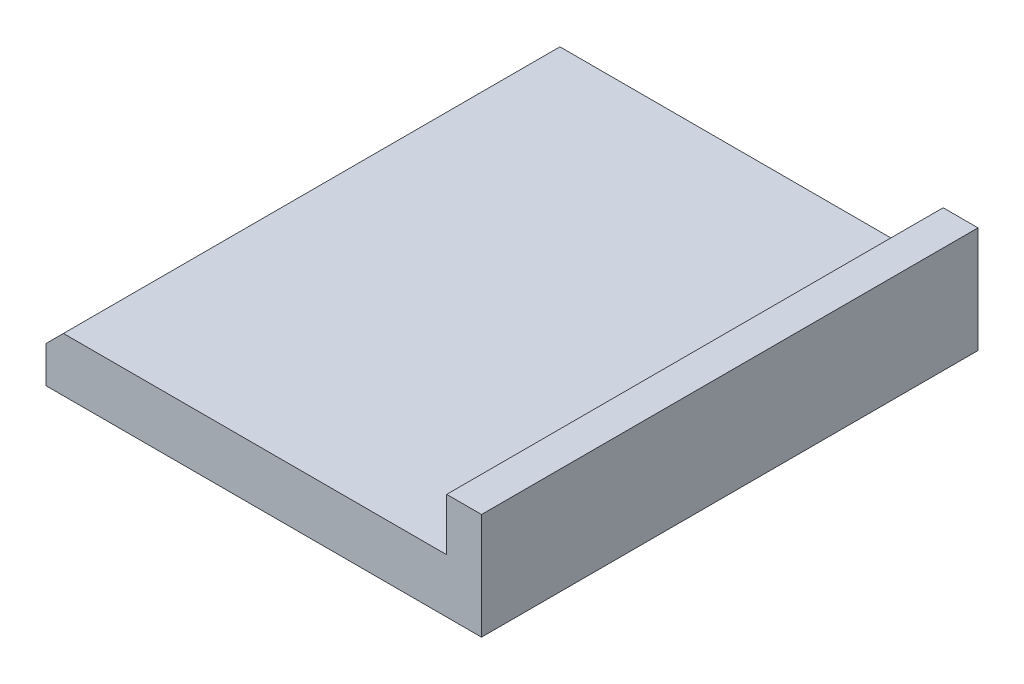
ISO-10303-21;
HEADER;
FILE_DESCRIPTION(('STEP AP214'),'2;1');
FILE_NAME('part.step','',(''),(''),'','','');
FILE_SCHEMA(('AUTOMOTIVE_DESIGN { 1 0 10303 214 1 1 1 1 }'));
ENDSEC;
DATA;
#1=APPLICATION_CONTEXT('core data for automotive mechanical design processes');
#2=APPLICATION_PROTOCOL_DEFINITION('international standard','automotive_design',2000,#1);
#3=PRODUCT_CONTEXT('',#1,'mechanical');
#4=PRODUCT('Part','Part','',(#3));
#5=PRODUCT_RELATED_PRODUCT_CATEGORY('part','',(#4));
#6=PRODUCT_DEFINITION_FORMATION('','',#4);
#7=PRODUCT_DEFINITION_CONTEXT('part definition',#1,'design');
#8=PRODUCT_DEFINITION('design','',#6,#7);
#9=PRODUCT_DEFINITION_SHAPE('','',#8);
#10=(LENGTH_UNIT() NAMED_UNIT(*) SI_UNIT(.MILLI.,.METRE.));
#11=(NAMED_UNIT(*) PLANE_ANGLE_UNIT() SI_UNIT($,.RADIAN.));
#12=(NAMED_UNIT(*) SI_UNIT($,.STERADIAN.) SOLID_ANGLE_UNIT());
#13=UNCERTAINTY_MEASURE_WITH_UNIT(LENGTH_MEASURE(1.E-05),#10,'distance_accuracy_value','');
#14=(GEOMETRIC_REPRESENTATION_CONTEXT(3) GLOBAL_UNCERTAINTY_ASSIGNED_CONTEXT((#13)) GLOBAL_UNIT_ASSIGNED_CONTEXT((#10,
#11,#12)) REPRESENTATION_CONTEXT('',''));
#15=CARTESIAN_POINT('',(0.,0.,0.));
#16=DIRECTION('',(0.,0.,1.));
#17=DIRECTION('',(1.,0.,0.));
#18=AXIS2_PLACEMENT_3D('',#15,#16,#17);
#19=CARTESIAN_POINT('',(-15.8056066176471,3.3,-12.6783088235294));
#20=DIRECTION('',(1.,0.,0.));
#21=DIRECTION('',(0.,0.,-1.));
#22=AXIS2_PLACEMENT_3D('',#19,#20,#21);
#23=PLANE('',#22);
#24=DIRECTION('',(0.,0.,-1.));
#25=VECTOR('',#24,1.);
#26=CARTESIAN_POINT('',(-15.8056066176471,0.2,-12.6783088235294));
#27=LINE('',#26,#25);
#28=CARTESIAN_POINT('',(-15.8056066176471,0.2,15.8216911764706));
#29=VERTEX_POINT('',#28);
#30=CARTESIAN_POINT('',(-15.8056066176471,0.2,-12.6783088235294));
#31=VERTEX_POINT('',#30);
#32=EDGE_CURVE('E47',#29,#31,#27,.T.);
#33=ORIENTED_EDGE('',*,*,#32,.F.);
#34=DIRECTION('',(0.,-1.,0.));
#35=VECTOR('',#34,1.);
#36=CARTESIAN_POINT('',(-15.8056066176471,3.3,15.8216911764706));
#37=LINE('',#36,#35);
#38=CARTESIAN_POINT('',(-15.8056066176471,2.29999999999999,15.8216911764706));
#39=VERTEX_POINT('',#38);
#40=EDGE_CURVE('E111',#39,#29,#37,.T.);
#41=ORIENTED_EDGE('',*,*,#40,.F.);
#42=DIRECTION('',(0.,0.,-1.));
#43=VECTOR('',#42,1.);
#44=CARTESIAN_POINT('',(-15.8056066176471,2.29999999999999,-12.6783088235294));
#45=LINE('',#44,#43);
#46=CARTESIAN_POINT('',(-15.8056066176471,2.29999999999999,-12.6783088235294));
#47=VERTEX_POINT('',#46);
#48=EDGE_CURVE('E55',#39,#47,#45,.T.);
#49=ORIENTED_EDGE('',*,*,#48,.T.);
#50=DIRECTION('',(0.,-1.,0.));
#51=VECTOR('',#50,1.);
#52=CARTESIAN_POINT('',(-15.8056066176471,3.3,-12.6783088235294));
#53=LINE('',#52,#51);
#54=EDGE_CURVE('E109',#47,#31,#53,.T.);
#55=ORIENTED_EDGE('',*,*,#54,.T.);
#56=EDGE_LOOP('',(#33,#41,#49,#55));
#57=FACE_BOUND('',#56,.T.);
#58=ADVANCED_FACE('F33',(#57),#23,.F.);
#59=CARTESIAN_POINT('',(-15.8056066176471,3.3,15.8216911764706));
#60=DIRECTION('',(0.,0.,-1.));
#61=DIRECTION('',(-1.,0.,0.));
#62=AXIS2_PLACEMENT_3D('',#59,#60,#61);
#63=PLANE('',#62);
#64=DIRECTION('',(-1.,0.,0.));
#65=VECTOR('',#64,1.);
#66=CARTESIAN_POINT('',(-15.8056066176471,0.2,15.8216911764706));
#67=LINE('',#66,#65);
#68=CARTESIAN_POINT('',(9.19439338235294,0.2,15.8216911764706));
#69=VERTEX_POINT('',#68);
#70=EDGE_CURVE('E103',#69,#29,#67,.T.);
#71=ORIENTED_EDGE('',*,*,#70,.F.);
#72=DIRECTION('',(0.,-1.,0.));
#73=VECTOR('',#72,1.);
#74=CARTESIAN_POINT('',(9.19439338235294,3.3,15.8216911764706));
#75=LINE('',#74,#73);
#76=CARTESIAN_POINT('',(9.19439338235294,6.3,15.8216911764706));
#77=VERTEX_POINT('',#76);
#78=EDGE_CURVE('E102',#77,#69,#75,.T.);
#79=ORIENTED_EDGE('',*,*,#78,.F.);
#80=DIRECTION('',(1.,0.,0.));
#81=VECTOR('',#80,1.);
#82=CARTESIAN_POINT('',(9.19439338235294,6.3,15.8216911764706));
#83=LINE('',#82,#81);
#84=CARTESIAN_POINT('',(7.19439338235294,6.3,15.8216911764706));
#85=VERTEX_POINT('',#84);
#86=EDGE_CURVE('E148',#85,#77,#83,.T.);
#87=ORIENTED_EDGE('',*,*,#86,.F.);
#88=DIRECTION('',(0.,-1.,0.));
#89=VECTOR('',#88,1.);
#90=CARTESIAN_POINT('',(7.19439338235294,6.3,15.8216911764706));
#91=LINE('',#90,#89);
#92=CARTESIAN_POINT('',(7.19439338235294,3.3,15.8216911764706));
#93=VERTEX_POINT('',#92);
#94=EDGE_CURVE('E150',#85,#93,#91,.T.);
#95=ORIENTED_EDGE('',*,*,#94,.T.);
#96=DIRECTION('',(1.,0.,0.));
#97=VECTOR('',#96,1.);
#98=CARTESIAN_POINT('',(-15.8056066176471,3.3,15.8216911764706));
#99=LINE('',#98,#97);
#100=CARTESIAN_POINT('',(-14.8056066176471,3.3,15.8216911764706));
#101=VERTEX_POINT('',#100);
#102=EDGE_CURVE('E135',#101,#93,#99,.T.);
#103=ORIENTED_EDGE('',*,*,#102,.F.);
#104=DIRECTION('',(-0.707106781186546,-0.707106781186549,0.));
#105=VECTOR('',#104,1.);
#106=CARTESIAN_POINT('',(-14.8056066176471,3.3,15.8216911764706));
#107=LINE('',#106,#105);
#108=EDGE_CURVE('E122',#101,#39,#107,.T.);
#109=ORIENTED_EDGE('',*,*,#108,.T.);
#110=ORIENTED_EDGE('',*,*,#40,.T.);
#111=EDGE_LOOP('',(#71,#79,#87,#95,#103,#109,#110));
#112=FACE_BOUND('',#111,.T.);
#113=ADVANCED_FACE('F137',(#112),#63,.F.);
#114=CARTESIAN_POINT('',(9.19439338235294,3.3,-12.6783088235294));
#115=DIRECTION('',(-1.,0.,0.));
#116=DIRECTION('',(0.,0.,1.));
#117=AXIS2_PLACEMENT_3D('',#114,#115,#116);
#118=PLANE('',#117);
#119=DIRECTION('',(0.,0.,1.));
#120=VECTOR('',#119,1.);
#121=CARTESIAN_POINT('',(9.19439338235294,0.2,-12.6783088235294));
#122=LINE('',#121,#120);
#123=CARTESIAN_POINT('',(9.19439338235294,0.2,-12.6783088235294));
#124=VERTEX_POINT('',#123);
#125=EDGE_CURVE('E92',#124,#69,#122,.T.);
#126=ORIENTED_EDGE('',*,*,#125,.F.);
#127=DIRECTION('',(0.,-1.,0.));
#128=VECTOR('',#127,1.);
#129=CARTESIAN_POINT('',(9.19439338235294,3.3,-12.6783088235294));
#130=LINE('',#129,#128);
#131=CARTESIAN_POINT('',(9.19439338235294,6.3,-12.6783088235294));
#132=VERTEX_POINT('',#131);
#133=EDGE_CURVE('E100',#132,#124,#130,.T.);
#134=ORIENTED_EDGE('',*,*,#133,.F.);
#135=DIRECTION('',(0.,0.,-1.));
#136=VECTOR('',#135,1.);
#137=CARTESIAN_POINT('',(9.19439338235294,6.3,-12.6783088235294));
#138=LINE('',#137,#136);
#139=EDGE_CURVE('E140',#77,#132,#138,.T.);
#140=ORIENTED_EDGE('',*,*,#139,.F.);
#141=ORIENTED_EDGE('',*,*,#78,.T.);
#142=EDGE_LOOP('',(#126,#134,#140,#141));
#143=FACE_BOUND('',#142,.T.);
#144=ADVANCED_FACE('F98',(#143),#118,.F.);
#145=CARTESIAN_POINT('',(-15.8056066176471,3.3,-12.6783088235294));
#146=DIRECTION('',(0.,0.,1.));
#147=DIRECTION('',(1.,0.,0.));
#148=AXIS2_PLACEMENT_3D('',#145,#146,#147);
#149=PLANE('',#148);
#150=DIRECTION('',(1.,0.,0.));
#151=VECTOR('',#150,1.);
#152=CARTESIAN_POINT('',(-15.8056066176471,0.2,-12.6783088235294));
#153=LINE('',#152,#151);
#154=EDGE_CURVE('E11',#31,#124,#153,.T.);
#155=ORIENTED_EDGE('',*,*,#154,.F.);
#156=ORIENTED_EDGE('',*,*,#54,.F.);
#157=DIRECTION('',(0.707106781186546,0.707106781186549,0.));
#158=VECTOR('',#157,1.);
#159=CARTESIAN_POINT('',(-14.8056066176471,3.3,-12.6783088235294));
#160=LINE('',#159,#158);
#161=CARTESIAN_POINT('',(-14.8056066176471,3.3,-12.6783088235294));
#162=VERTEX_POINT('',#161);
#163=EDGE_CURVE('E41',#47,#162,#160,.T.);
#164=ORIENTED_EDGE('',*,*,#163,.T.);
#165=DIRECTION('',(-1.,0.,0.));
#166=VECTOR('',#165,1.);
#167=CARTESIAN_POINT('',(-15.8056066176471,3.3,-12.6783088235294));
#168=LINE('',#167,#166);
#169=CARTESIAN_POINT('',(7.19439338235294,3.3,-12.6783088235294));
#170=VERTEX_POINT('',#169);
#171=EDGE_CURVE('E113',#170,#162,#168,.T.);
#172=ORIENTED_EDGE('',*,*,#171,.F.);
#173=DIRECTION('',(0.,-1.,0.));
#174=VECTOR('',#173,1.);
#175=CARTESIAN_POINT('',(7.19439338235294,6.3,-12.6783088235294));
#176=LINE('',#175,#174);
#177=CARTESIAN_POINT('',(7.19439338235294,6.3,-12.6783088235294));
#178=VERTEX_POINT('',#177);
#179=EDGE_CURVE('E153',#178,#170,#176,.T.);
#180=ORIENTED_EDGE('',*,*,#179,.F.);
#181=DIRECTION('',(-1.,0.,0.));
#182=VECTOR('',#181,1.);
#183=CARTESIAN_POINT('',(9.19439338235294,6.3,-12.6783088235294));
#184=LINE('',#183,#182);
#185=EDGE_CURVE('E107',#132,#178,#184,.T.);
#186=ORIENTED_EDGE('',*,*,#185,.F.);
#187=ORIENTED_EDGE('',*,*,#133,.T.);
#188=EDGE_LOOP('',(#155,#156,#164,#172,#180,#186,#187));
#189=FACE_BOUND('',#188,.T.);
#190=ADVANCED_FACE('F105',(#189),#149,.F.);
#191=CARTESIAN_POINT('',(0.,3.3,0.));
#192=DIRECTION('',(0.,1.,0.));
#193=DIRECTION('',(0.,0.,1.));
#194=AXIS2_PLACEMENT_3D('',#191,#192,#193);
#195=PLANE('',#194);
#196=ORIENTED_EDGE('',*,*,#171,.T.);
#197=DIRECTION('',(0.,0.,1.));
#198=VECTOR('',#197,1.);
#199=CARTESIAN_POINT('',(-14.8056066176471,3.3,15.8216911764706));
#200=LINE('',#199,#198);
#201=EDGE_CURVE('E119',#162,#101,#200,.T.);
#202=ORIENTED_EDGE('',*,*,#201,.T.);
#203=ORIENTED_EDGE('',*,*,#102,.T.);
#204=DIRECTION('',(0.,0.,1.));
#205=VECTOR('',#204,1.);
#206=CARTESIAN_POINT('',(7.19439338235294,3.3,-12.6783088235294));
#207=LINE('',#206,#205);
#208=EDGE_CURVE('E134',#170,#93,#207,.T.);
#209=ORIENTED_EDGE('',*,*,#208,.F.);
#210=EDGE_LOOP('',(#196,#202,#203,#209));
#211=FACE_BOUND('',#210,.T.);
#212=ADVANCED_FACE('F131',(#211),#195,.T.);
#213=CARTESIAN_POINT('',(7.19439338235294,6.3,-12.6783088235294));
#214=DIRECTION('',(1.,0.,0.));
#215=DIRECTION('',(0.,0.,-1.));
#216=AXIS2_PLACEMENT_3D('',#213,#214,#215);
#217=PLANE('',#216);
#218=ORIENTED_EDGE('',*,*,#208,.T.);
#219=ORIENTED_EDGE('',*,*,#94,.F.);
#220=DIRECTION('',(0.,0.,1.));
#221=VECTOR('',#220,1.);
#222=CARTESIAN_POINT('',(7.19439338235294,6.3,-12.6783088235294));
#223=LINE('',#222,#221);
#224=EDGE_CURVE('E146',#178,#85,#223,.T.);
#225=ORIENTED_EDGE('',*,*,#224,.F.);
#226=ORIENTED_EDGE('',*,*,#179,.T.);
#227=EDGE_LOOP('',(#218,#219,#225,#226));
#228=FACE_BOUND('',#227,.T.);
#229=ADVANCED_FACE('F157',(#228),#217,.F.);
#230=CARTESIAN_POINT('',(0.,6.3,0.));
#231=DIRECTION('',(0.,-1.,0.));
#232=DIRECTION('',(0.,0.,-1.));
#233=AXIS2_PLACEMENT_3D('',#230,#231,#232);
#234=PLANE('',#233);
#235=ORIENTED_EDGE('',*,*,#139,.T.);
#236=ORIENTED_EDGE('',*,*,#185,.T.);
#237=ORIENTED_EDGE('',*,*,#224,.T.);
#238=ORIENTED_EDGE('',*,*,#86,.T.);
#239=EDGE_LOOP('',(#235,#236,#237,#238));
#240=FACE_BOUND('',#239,.T.);
#241=ADVANCED_FACE('F161',(#240),#234,.F.);
#242=CARTESIAN_POINT('',(-14.8056066176471,3.3,0.));
#243=DIRECTION('',(-0.707106781186549,0.707106781186546,0.));
#244=DIRECTION('',(0.,0.,-1.));
#245=AXIS2_PLACEMENT_3D('',#242,#243,#244);
#246=PLANE('',#245);
#247=ORIENTED_EDGE('',*,*,#163,.F.);
#248=ORIENTED_EDGE('',*,*,#48,.F.);
#249=ORIENTED_EDGE('',*,*,#108,.F.);
#250=ORIENTED_EDGE('',*,*,#201,.F.);
#251=EDGE_LOOP('',(#247,#248,#249,#250));
#252=FACE_BOUND('',#251,.T.);
#253=ADVANCED_FACE('F35',(#252),#246,.T.);
#254=CARTESIAN_POINT('',(-2.84782065312892,0.2,0.));
#255=DIRECTION('',(0.,-1.,0.));
#256=DIRECTION('',(0.,0.,-1.));
#257=AXIS2_PLACEMENT_3D('',#254,#255,#256);
#258=PLANE('',#257);
#259=ORIENTED_EDGE('',*,*,#32,.T.);
#260=ORIENTED_EDGE('',*,*,#154,.T.);
#261=ORIENTED_EDGE('',*,*,#125,.T.);
#262=ORIENTED_EDGE('',*,*,#70,.T.);
#263=EDGE_LOOP('',(#259,#260,#261,#262));
#264=FACE_BOUND('',#263,.T.);
#265=ADVANCED_FACE('F91',(#264),#258,.T.);
#266=CLOSED_SHELL('',(#58,#113,#144,#190,#212,#229,#241,#253,#265));
#267=MANIFOLD_SOLID_BREP('B2',#266);
#268=ADVANCED_BREP_SHAPE_REPRESENTATION('',(#18,#267),#14);
#269=SHAPE_DEFINITION_REPRESENTATION(#9,#268);
ENDSEC;
END-ISO-10303-21;
